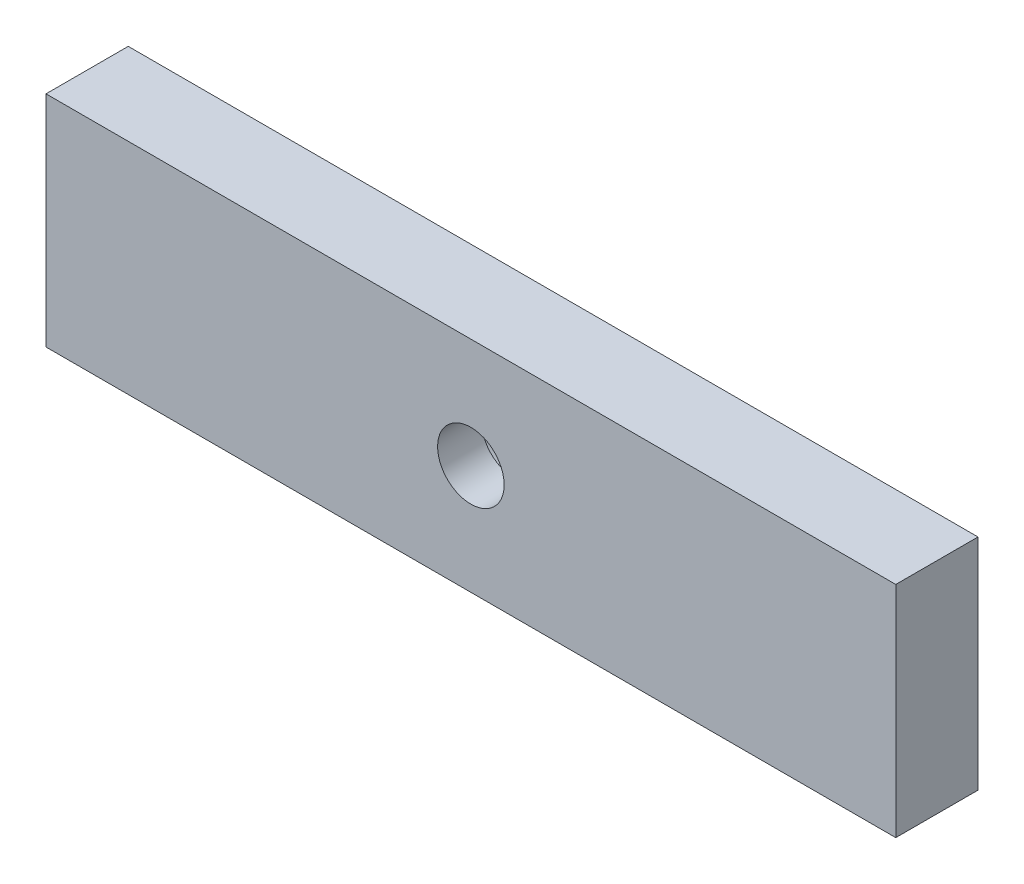
ISO-10303-21;
HEADER;
FILE_DESCRIPTION(('STEP AP214'),'2;1');
FILE_NAME('part.step','',(''),(''),'','','');
FILE_SCHEMA(('AUTOMOTIVE_DESIGN { 1 0 10303 214 1 1 1 1 }'));
ENDSEC;
DATA;
#1=APPLICATION_CONTEXT('core data for automotive mechanical design processes');
#2=APPLICATION_PROTOCOL_DEFINITION('international standard','automotive_design',2000,#1);
#3=PRODUCT_CONTEXT('',#1,'mechanical');
#4=PRODUCT('Part','Part','',(#3));
#5=PRODUCT_RELATED_PRODUCT_CATEGORY('part','',(#4));
#6=PRODUCT_DEFINITION_FORMATION('','',#4);
#7=PRODUCT_DEFINITION_CONTEXT('part definition',#1,'design');
#8=PRODUCT_DEFINITION('design','',#6,#7);
#9=PRODUCT_DEFINITION_SHAPE('','',#8);
#10=(LENGTH_UNIT() NAMED_UNIT(*) SI_UNIT(.MILLI.,.METRE.));
#11=(NAMED_UNIT(*) PLANE_ANGLE_UNIT() SI_UNIT($,.RADIAN.));
#12=(NAMED_UNIT(*) SI_UNIT($,.STERADIAN.) SOLID_ANGLE_UNIT());
#13=UNCERTAINTY_MEASURE_WITH_UNIT(LENGTH_MEASURE(1.E-05),#10,'distance_accuracy_value','');
#14=(GEOMETRIC_REPRESENTATION_CONTEXT(3) GLOBAL_UNCERTAINTY_ASSIGNED_CONTEXT((#13)) GLOBAL_UNIT_ASSIGNED_CONTEXT((#10,
#11,#12)) REPRESENTATION_CONTEXT('',''));
#15=CARTESIAN_POINT('',(0.,0.,0.));
#16=DIRECTION('',(0.,0.,1.));
#17=DIRECTION('',(1.,0.,0.));
#18=AXIS2_PLACEMENT_3D('',#15,#16,#17);
#19=CARTESIAN_POINT('',(77.5,20.,15.));
#20=DIRECTION('',(-1.,0.,0.));
#21=DIRECTION('',(0.,0.,1.));
#22=AXIS2_PLACEMENT_3D('',#19,#20,#21);
#23=PLANE('',#22);
#24=DIRECTION('',(0.,1.,0.));
#25=VECTOR('',#24,1.);
#26=CARTESIAN_POINT('',(77.5,20.,0.));
#27=LINE('',#26,#25);
#28=CARTESIAN_POINT('',(77.5,-20.,0.));
#29=VERTEX_POINT('',#28);
#30=CARTESIAN_POINT('',(77.5,20.,0.));
#31=VERTEX_POINT('',#30);
#32=EDGE_CURVE('E98',#29,#31,#27,.T.);
#33=ORIENTED_EDGE('',*,*,#32,.T.);
#34=DIRECTION('',(0.,0.,-1.));
#35=VECTOR('',#34,1.);
#36=CARTESIAN_POINT('',(77.5,20.,15.));
#37=LINE('',#36,#35);
#38=CARTESIAN_POINT('',(77.5,20.,15.));
#39=VERTEX_POINT('',#38);
#40=EDGE_CURVE('E11',#39,#31,#37,.T.);
#41=ORIENTED_EDGE('',*,*,#40,.F.);
#42=DIRECTION('',(0.,1.,0.));
#43=VECTOR('',#42,1.);
#44=CARTESIAN_POINT('',(77.5,20.,15.));
#45=LINE('',#44,#43);
#46=CARTESIAN_POINT('',(77.5,-20.,15.));
#47=VERTEX_POINT('',#46);
#48=EDGE_CURVE('E85',#47,#39,#45,.T.);
#49=ORIENTED_EDGE('',*,*,#48,.F.);
#50=DIRECTION('',(0.,0.,-1.));
#51=VECTOR('',#50,1.);
#52=CARTESIAN_POINT('',(77.5,-20.,15.));
#53=LINE('',#52,#51);
#54=EDGE_CURVE('E94',#47,#29,#53,.T.);
#55=ORIENTED_EDGE('',*,*,#54,.T.);
#56=EDGE_LOOP('',(#33,#41,#49,#55));
#57=FACE_BOUND('',#56,.T.);
#58=ADVANCED_FACE('F33',(#57),#23,.F.);
#59=CARTESIAN_POINT('',(-77.5,20.,15.));
#60=DIRECTION('',(0.,-1.,0.));
#61=DIRECTION('',(0.,0.,-1.));
#62=AXIS2_PLACEMENT_3D('',#59,#60,#61);
#63=PLANE('',#62);
#64=DIRECTION('',(-1.,0.,0.));
#65=VECTOR('',#64,1.);
#66=CARTESIAN_POINT('',(-77.5,20.,0.));
#67=LINE('',#66,#65);
#68=CARTESIAN_POINT('',(-77.5,20.,0.));
#69=VERTEX_POINT('',#68);
#70=EDGE_CURVE('E89',#31,#69,#67,.T.);
#71=ORIENTED_EDGE('',*,*,#70,.T.);
#72=DIRECTION('',(0.,0.,-1.));
#73=VECTOR('',#72,1.);
#74=CARTESIAN_POINT('',(-77.5,20.,15.));
#75=LINE('',#74,#73);
#76=CARTESIAN_POINT('',(-77.5,20.,15.));
#77=VERTEX_POINT('',#76);
#78=EDGE_CURVE('E42',#77,#69,#75,.T.);
#79=ORIENTED_EDGE('',*,*,#78,.F.);
#80=DIRECTION('',(-1.,0.,0.));
#81=VECTOR('',#80,1.);
#82=CARTESIAN_POINT('',(-77.5,20.,15.));
#83=LINE('',#82,#81);
#84=EDGE_CURVE('E80',#39,#77,#83,.T.);
#85=ORIENTED_EDGE('',*,*,#84,.F.);
#86=ORIENTED_EDGE('',*,*,#40,.T.);
#87=EDGE_LOOP('',(#71,#79,#85,#86));
#88=FACE_BOUND('',#87,.T.);
#89=ADVANCED_FACE('F88',(#88),#63,.F.);
#90=CARTESIAN_POINT('',(-77.5,20.,15.));
#91=DIRECTION('',(1.,0.,0.));
#92=DIRECTION('',(0.,0.,-1.));
#93=AXIS2_PLACEMENT_3D('',#90,#91,#92);
#94=PLANE('',#93);
#95=DIRECTION('',(0.,-1.,0.));
#96=VECTOR('',#95,1.);
#97=CARTESIAN_POINT('',(-77.5,20.,0.));
#98=LINE('',#97,#96);
#99=CARTESIAN_POINT('',(-77.5,-20.,0.));
#100=VERTEX_POINT('',#99);
#101=EDGE_CURVE('E67',#69,#100,#98,.T.);
#102=ORIENTED_EDGE('',*,*,#101,.T.);
#103=DIRECTION('',(0.,0.,-1.));
#104=VECTOR('',#103,1.);
#105=CARTESIAN_POINT('',(-77.5,-20.,15.));
#106=LINE('',#105,#104);
#107=CARTESIAN_POINT('',(-77.5,-20.,15.));
#108=VERTEX_POINT('',#107);
#109=EDGE_CURVE('E90',#108,#100,#106,.T.);
#110=ORIENTED_EDGE('',*,*,#109,.F.);
#111=DIRECTION('',(0.,-1.,0.));
#112=VECTOR('',#111,1.);
#113=CARTESIAN_POINT('',(-77.5,20.,15.));
#114=LINE('',#113,#112);
#115=EDGE_CURVE('E83',#77,#108,#114,.T.);
#116=ORIENTED_EDGE('',*,*,#115,.F.);
#117=ORIENTED_EDGE('',*,*,#78,.T.);
#118=EDGE_LOOP('',(#102,#110,#116,#117));
#119=FACE_BOUND('',#118,.T.);
#120=ADVANCED_FACE('F92',(#119),#94,.F.);
#121=CARTESIAN_POINT('',(-77.5,-20.,15.));
#122=DIRECTION('',(0.,1.,0.));
#123=DIRECTION('',(0.,0.,1.));
#124=AXIS2_PLACEMENT_3D('',#121,#122,#123);
#125=PLANE('',#124);
#126=DIRECTION('',(1.,0.,0.));
#127=VECTOR('',#126,1.);
#128=CARTESIAN_POINT('',(-77.5,-20.,0.));
#129=LINE('',#128,#127);
#130=EDGE_CURVE('E73',#100,#29,#129,.T.);
#131=ORIENTED_EDGE('',*,*,#130,.T.);
#132=ORIENTED_EDGE('',*,*,#54,.F.);
#133=DIRECTION('',(1.,0.,0.));
#134=VECTOR('',#133,1.);
#135=CARTESIAN_POINT('',(-77.5,-20.,15.));
#136=LINE('',#135,#134);
#137=EDGE_CURVE('E50',#108,#47,#136,.T.);
#138=ORIENTED_EDGE('',*,*,#137,.F.);
#139=ORIENTED_EDGE('',*,*,#109,.T.);
#140=EDGE_LOOP('',(#131,#132,#138,#139));
#141=FACE_BOUND('',#140,.T.);
#142=ADVANCED_FACE('F106',(#141),#125,.F.);
#143=CARTESIAN_POINT('',(0.,0.,15.));
#144=DIRECTION('',(0.,0.,1.));
#145=DIRECTION('',(1.,0.,0.));
#146=AXIS2_PLACEMENT_3D('',#143,#144,#145);
#147=PLANE('',#146);
#148=CARTESIAN_POINT('',(0.,0.,15.));
#149=DIRECTION('',(0.,0.,-1.));
#150=DIRECTION('',(-1.,0.,0.));
#151=AXIS2_PLACEMENT_3D('',#148,#149,#150);
#152=CIRCLE('',#151,6.07078699922616);
#153=CARTESIAN_POINT('',(-6.07078699922616,0.,15.));
#154=VERTEX_POINT('',#153);
#155=EDGE_CURVE('E117',#154,#154,#152,.T.);
#156=ORIENTED_EDGE('',*,*,#155,.T.);
#157=EDGE_LOOP('',(#156));
#158=FACE_BOUND('',#157,.T.);
#159=ORIENTED_EDGE('',*,*,#48,.T.);
#160=ORIENTED_EDGE('',*,*,#84,.T.);
#161=ORIENTED_EDGE('',*,*,#115,.T.);
#162=ORIENTED_EDGE('',*,*,#137,.T.);
#163=EDGE_LOOP('',(#159,#160,#161,#162));
#164=FACE_BOUND('',#163,.T.);
#165=ADVANCED_FACE('F81',(#158,#164),#147,.T.);
#166=CARTESIAN_POINT('',(0.,0.,0.));
#167=DIRECTION('',(0.,0.,1.));
#168=DIRECTION('',(1.,0.,0.));
#169=AXIS2_PLACEMENT_3D('',#166,#167,#168);
#170=PLANE('',#169);
#171=CARTESIAN_POINT('',(0.,0.,0.));
#172=DIRECTION('',(0.,0.,-1.));
#173=DIRECTION('',(-1.,0.,0.));
#174=AXIS2_PLACEMENT_3D('',#171,#172,#173);
#175=CIRCLE('',#174,11.);
#176=CARTESIAN_POINT('',(-11.,0.,0.));
#177=VERTEX_POINT('',#176);
#178=EDGE_CURVE('E112',#177,#177,#175,.T.);
#179=ORIENTED_EDGE('',*,*,#178,.F.);
#180=EDGE_LOOP('',(#179));
#181=FACE_BOUND('',#180,.T.);
#182=ORIENTED_EDGE('',*,*,#32,.F.);
#183=ORIENTED_EDGE('',*,*,#130,.F.);
#184=ORIENTED_EDGE('',*,*,#101,.F.);
#185=ORIENTED_EDGE('',*,*,#70,.F.);
#186=EDGE_LOOP('',(#182,#183,#184,#185));
#187=FACE_BOUND('',#186,.T.);
#188=ADVANCED_FACE('F109',(#181,#187),#170,.F.);
#189=CARTESIAN_POINT('',(0.,0.,7.));
#190=DIRECTION('',(0.,0.,-1.));
#191=DIRECTION('',(-1.,0.,0.));
#192=AXIS2_PLACEMENT_3D('',#189,#190,#191);
#193=CYLINDRICAL_SURFACE('',#192,11.);
#194=CARTESIAN_POINT('',(0.,0.,7.));
#195=DIRECTION('',(0.,0.,-1.));
#196=DIRECTION('',(-1.,0.,0.));
#197=AXIS2_PLACEMENT_3D('',#194,#195,#196);
#198=CIRCLE('',#197,11.);
#199=CARTESIAN_POINT('',(-11.,0.,7.));
#200=VERTEX_POINT('',#199);
#201=EDGE_CURVE('E101',#200,#200,#198,.T.);
#202=ORIENTED_EDGE('',*,*,#201,.F.);
#203=EDGE_LOOP('',(#202));
#204=FACE_BOUND('',#203,.T.);
#205=ORIENTED_EDGE('',*,*,#178,.T.);
#206=EDGE_LOOP('',(#205));
#207=FACE_BOUND('',#206,.T.);
#208=ADVANCED_FACE('F130',(#204,#207),#193,.F.);
#209=CARTESIAN_POINT('',(0.,0.,7.));
#210=DIRECTION('',(0.,0.,-1.));
#211=DIRECTION('',(-1.,0.,0.));
#212=AXIS2_PLACEMENT_3D('',#209,#210,#211);
#213=PLANE('',#212);
#214=CARTESIAN_POINT('',(0.,0.,7.));
#215=DIRECTION('',(0.,0.,-1.));
#216=DIRECTION('',(-1.,0.,0.));
#217=AXIS2_PLACEMENT_3D('',#214,#215,#216);
#218=CIRCLE('',#217,6.07078699922616);
#219=CARTESIAN_POINT('',(-6.07078699922616,0.,7.));
#220=VERTEX_POINT('',#219);
#221=EDGE_CURVE('E36',#220,#220,#218,.T.);
#222=ORIENTED_EDGE('',*,*,#221,.F.);
#223=EDGE_LOOP('',(#222));
#224=FACE_BOUND('',#223,.T.);
#225=ORIENTED_EDGE('',*,*,#201,.T.);
#226=EDGE_LOOP('',(#225));
#227=FACE_BOUND('',#226,.T.);
#228=ADVANCED_FACE('F127',(#224,#227),#213,.T.);
#229=CARTESIAN_POINT('',(0.,0.,15.));
#230=DIRECTION('',(0.,0.,-1.));
#231=DIRECTION('',(-1.,0.,0.));
#232=AXIS2_PLACEMENT_3D('',#229,#230,#231);
#233=CYLINDRICAL_SURFACE('',#232,6.07078699922616);
#234=ORIENTED_EDGE('',*,*,#221,.T.);
#235=EDGE_LOOP('',(#234));
#236=FACE_BOUND('',#235,.T.);
#237=ORIENTED_EDGE('',*,*,#155,.F.);
#238=EDGE_LOOP('',(#237));
#239=FACE_BOUND('',#238,.T.);
#240=ADVANCED_FACE('F124',(#236,#239),#233,.F.);
#241=CLOSED_SHELL('',(#58,#89,#120,#142,#165,#188,#208,#228,#240));
#242=MANIFOLD_SOLID_BREP('B2',#241);
#243=ADVANCED_BREP_SHAPE_REPRESENTATION('',(#18,#242),#14);
#244=SHAPE_DEFINITION_REPRESENTATION(#9,#243);
ENDSEC;
END-ISO-10303-21;
